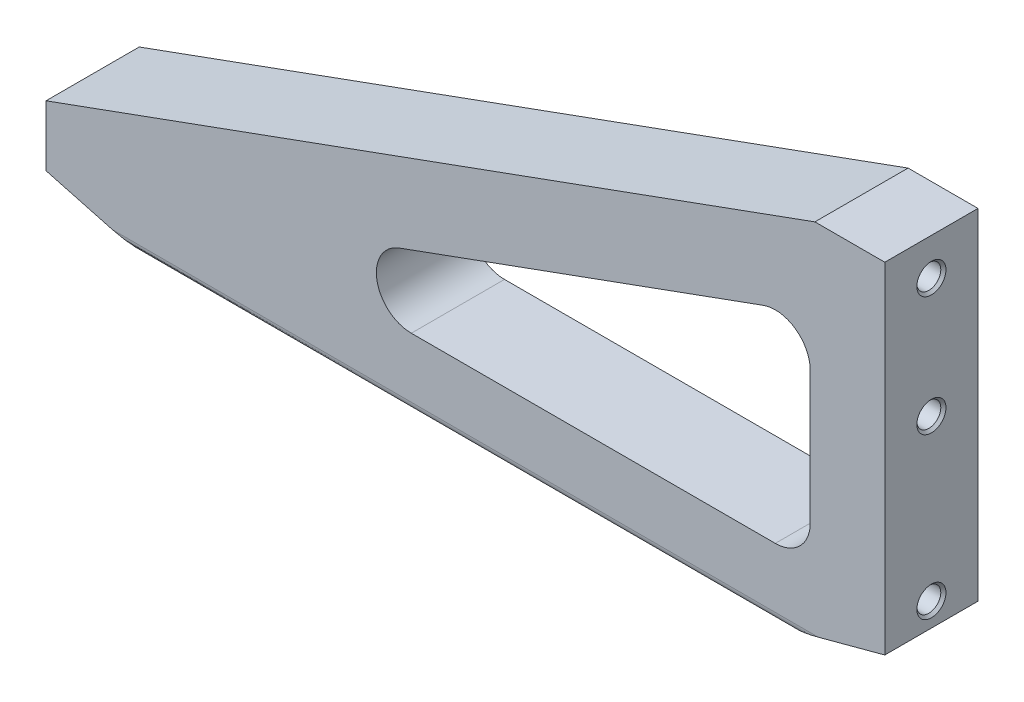
ISO-10303-21;
HEADER;
FILE_DESCRIPTION(('STEP AP214'),'2;1');
FILE_NAME('part.step','',(''),(''),'','','');
FILE_SCHEMA(('AUTOMOTIVE_DESIGN { 1 0 10303 214 1 1 1 1 }'));
ENDSEC;
DATA;
#1=APPLICATION_CONTEXT('core data for automotive mechanical design processes');
#2=APPLICATION_PROTOCOL_DEFINITION('international standard','automotive_design',2000,#1);
#3=PRODUCT_CONTEXT('',#1,'mechanical');
#4=PRODUCT('Part','Part','',(#3));
#5=PRODUCT_RELATED_PRODUCT_CATEGORY('part','',(#4));
#6=PRODUCT_DEFINITION_FORMATION('','',#4);
#7=PRODUCT_DEFINITION_CONTEXT('part definition',#1,'design');
#8=PRODUCT_DEFINITION('design','',#6,#7);
#9=PRODUCT_DEFINITION_SHAPE('','',#8);
#10=(LENGTH_UNIT() NAMED_UNIT(*) SI_UNIT(.MILLI.,.METRE.));
#11=(NAMED_UNIT(*) PLANE_ANGLE_UNIT() SI_UNIT($,.RADIAN.));
#12=(NAMED_UNIT(*) SI_UNIT($,.STERADIAN.) SOLID_ANGLE_UNIT());
#13=UNCERTAINTY_MEASURE_WITH_UNIT(LENGTH_MEASURE(1.E-05),#10,'distance_accuracy_value','');
#14=(GEOMETRIC_REPRESENTATION_CONTEXT(3) GLOBAL_UNCERTAINTY_ASSIGNED_CONTEXT((#13)) GLOBAL_UNIT_ASSIGNED_CONTEXT((#10,
#11,#12)) REPRESENTATION_CONTEXT('',''));
#15=CARTESIAN_POINT('',(0.,0.,0.));
#16=DIRECTION('',(0.,0.,1.));
#17=DIRECTION('',(1.,0.,0.));
#18=AXIS2_PLACEMENT_3D('',#15,#16,#17);
#19=CARTESIAN_POINT('',(0.,0.,12.7));
#20=DIRECTION('',(0.,0.,1.));
#21=DIRECTION('',(1.,0.,0.));
#22=AXIS2_PLACEMENT_3D('',#19,#20,#21);
#23=PLANE('',#22);
#24=DIRECTION('',(0.,1.,0.));
#25=VECTOR('',#24,1.);
#26=CARTESIAN_POINT('',(-20.32,12.5140664695066,12.7));
#27=LINE('',#26,#25);
#28=CARTESIAN_POINT('',(-20.32,-23.5585,12.7));
#29=VERTEX_POINT('',#28);
#30=CARTESIAN_POINT('',(-20.32,12.5140664695066,12.7));
#31=VERTEX_POINT('',#30);
#32=EDGE_CURVE('E206',#29,#31,#27,.T.);
#33=ORIENTED_EDGE('',*,*,#32,.F.);
#34=CARTESIAN_POINT('',(-29.845,-23.5585,12.7));
#35=DIRECTION('',(0.,0.,1.));
#36=DIRECTION('',(-1.,0.,0.));
#37=AXIS2_PLACEMENT_3D('',#34,#35,#36);
#38=CIRCLE('',#37,9.525);
#39=CARTESIAN_POINT('',(-29.845,-33.0835,12.7));
#40=VERTEX_POINT('',#39);
#41=EDGE_CURVE('E204',#40,#29,#38,.T.);
#42=ORIENTED_EDGE('',*,*,#41,.F.);
#43=DIRECTION('',(1.,0.,0.));
#44=VECTOR('',#43,1.);
#45=CARTESIAN_POINT('',(-129.044557791143,-33.0835,12.7));
#46=LINE('',#45,#44);
#47=CARTESIAN_POINT('',(-129.044557791143,-33.0835,12.7));
#48=VERTEX_POINT('',#47);
#49=EDGE_CURVE('E216',#48,#40,#46,.T.);
#50=ORIENTED_EDGE('',*,*,#49,.F.);
#51=CARTESIAN_POINT('',(-129.044557791143,-23.5585,12.7));
#52=DIRECTION('',(0.,0.,1.));
#53=DIRECTION('',(-1.,0.,0.));
#54=AXIS2_PLACEMENT_3D('',#51,#52,#53);
#55=CIRCLE('',#54,9.525);
#56=CARTESIAN_POINT('',(-132.299660467044,-14.6069676412726,12.7));
#57=VERTEX_POINT('',#56);
#58=EDGE_CURVE('E213',#57,#48,#55,.T.);
#59=ORIENTED_EDGE('',*,*,#58,.F.);
#60=DIRECTION('',(-0.939793423488437,-0.341743063086704,0.));
#61=VECTOR('',#60,1.);
#62=CARTESIAN_POINT('',(-33.1001026759009,21.465598828234,12.7));
#63=LINE('',#62,#61);
#64=CARTESIAN_POINT('',(-33.1001026759009,21.465598828234,12.7));
#65=VERTEX_POINT('',#64);
#66=EDGE_CURVE('E211',#65,#57,#63,.T.);
#67=ORIENTED_EDGE('',*,*,#66,.F.);
#68=CARTESIAN_POINT('',(-29.845,12.5140664695066,12.7));
#69=DIRECTION('',(0.,0.,1.));
#70=DIRECTION('',(-1.,0.,0.));
#71=AXIS2_PLACEMENT_3D('',#68,#69,#70);
#72=CIRCLE('',#71,9.525);
#73=EDGE_CURVE('E209',#31,#65,#72,.T.);
#74=ORIENTED_EDGE('',*,*,#73,.F.);
#75=EDGE_LOOP('',(#33,#42,#50,#59,#67,#74));
#76=FACE_BOUND('',#75,.T.);
#77=DIRECTION('',(0.965925826289068,-0.258819045102524,0.));
#78=VECTOR('',#77,1.);
#79=CARTESIAN_POINT('',(-228.6,-44.5135,12.7));
#80=LINE('',#79,#78);
#81=CARTESIAN_POINT('',(-228.6,-44.5135,12.7));
#82=VERTEX_POINT('',#81);
#83=CARTESIAN_POINT('',(-210.457748922224,-49.3747015251728,12.7));
#84=VERTEX_POINT('',#83);
#85=EDGE_CURVE('E259',#82,#84,#80,.T.);
#86=ORIENTED_EDGE('',*,*,#85,.T.);
#87=DIRECTION('',(1.,0.,0.));
#88=VECTOR('',#87,1.);
#89=CARTESIAN_POINT('',(0.,-49.3747015251727,12.7));
#90=LINE('',#89,#88);
#91=CARTESIAN_POINT('',(-18.1422510777758,-49.3747015251727,12.7));
#92=VERTEX_POINT('',#91);
#93=EDGE_CURVE('E14',#84,#92,#90,.T.);
#94=ORIENTED_EDGE('',*,*,#93,.T.);
#95=DIRECTION('',(0.965925826289068,0.258819045102522,0.));
#96=VECTOR('',#95,1.);
#97=CARTESIAN_POINT('',(-33.1779316792872,-53.4035,12.7));
#98=LINE('',#97,#96);
#99=CARTESIAN_POINT('',(0.,-44.5135,12.7));
#100=VERTEX_POINT('',#99);
#101=EDGE_CURVE('E261',#92,#100,#98,.T.);
#102=ORIENTED_EDGE('',*,*,#101,.T.);
#103=DIRECTION('',(0.,1.,0.));
#104=VECTOR('',#103,1.);
#105=CARTESIAN_POINT('',(0.,48.1965,12.7));
#106=LINE('',#105,#104);
#107=CARTESIAN_POINT('',(0.,48.1965,12.7));
#108=VERTEX_POINT('',#107);
#109=EDGE_CURVE('E249',#100,#108,#106,.T.);
#110=ORIENTED_EDGE('',*,*,#109,.T.);
#111=DIRECTION('',(-1.,0.,0.));
#112=VECTOR('',#111,1.);
#113=CARTESIAN_POINT('',(-19.05,48.1965,12.7));
#114=LINE('',#113,#112);
#115=CARTESIAN_POINT('',(-19.05,48.1965,12.7));
#116=VERTEX_POINT('',#115);
#117=EDGE_CURVE('E252',#108,#116,#114,.T.);
#118=ORIENTED_EDGE('',*,*,#117,.T.);
#119=DIRECTION('',(-0.939793423488437,-0.341743063086704,0.));
#120=VECTOR('',#119,1.);
#121=CARTESIAN_POINT('',(-19.05,48.1965,12.7));
#122=LINE('',#121,#120);
#123=CARTESIAN_POINT('',(-228.6,-28.0035,12.7));
#124=VERTEX_POINT('',#123);
#125=EDGE_CURVE('E255',#116,#124,#122,.T.);
#126=ORIENTED_EDGE('',*,*,#125,.T.);
#127=DIRECTION('',(0.,-1.,0.));
#128=VECTOR('',#127,1.);
#129=CARTESIAN_POINT('',(-228.6,-28.0035,12.7));
#130=LINE('',#129,#128);
#131=EDGE_CURVE('E257',#124,#82,#130,.T.);
#132=ORIENTED_EDGE('',*,*,#131,.T.);
#133=EDGE_LOOP('',(#86,#94,#102,#110,#118,#126,#132));
#134=FACE_BOUND('',#133,.T.);
#135=ADVANCED_FACE('F52',(#76,#134),#23,.T.);
#136=CARTESIAN_POINT('',(0.,0.,-12.7));
#137=DIRECTION('',(0.,0.,1.));
#138=DIRECTION('',(1.,0.,0.));
#139=AXIS2_PLACEMENT_3D('',#136,#137,#138);
#140=PLANE('',#139);
#141=CARTESIAN_POINT('',(-29.845,-23.5585,-12.7));
#142=DIRECTION('',(0.,0.,1.));
#143=DIRECTION('',(-1.,0.,0.));
#144=AXIS2_PLACEMENT_3D('',#141,#142,#143);
#145=CIRCLE('',#144,9.525);
#146=CARTESIAN_POINT('',(-29.845,-33.0835,-12.7));
#147=VERTEX_POINT('',#146);
#148=CARTESIAN_POINT('',(-20.32,-23.5585,-12.7));
#149=VERTEX_POINT('',#148);
#150=EDGE_CURVE('E203',#147,#149,#145,.T.);
#151=ORIENTED_EDGE('',*,*,#150,.T.);
#152=DIRECTION('',(0.,1.,0.));
#153=VECTOR('',#152,1.);
#154=CARTESIAN_POINT('',(-20.32,12.5140664695066,-12.7));
#155=LINE('',#154,#153);
#156=CARTESIAN_POINT('',(-20.32,12.5140664695066,-12.7));
#157=VERTEX_POINT('',#156);
#158=EDGE_CURVE('E221',#149,#157,#155,.T.);
#159=ORIENTED_EDGE('',*,*,#158,.T.);
#160=CARTESIAN_POINT('',(-29.845,12.5140664695066,-12.7));
#161=DIRECTION('',(0.,0.,1.));
#162=DIRECTION('',(-1.,0.,0.));
#163=AXIS2_PLACEMENT_3D('',#160,#161,#162);
#164=CIRCLE('',#163,9.525);
#165=CARTESIAN_POINT('',(-33.1001026759009,21.465598828234,-12.7));
#166=VERTEX_POINT('',#165);
#167=EDGE_CURVE('E224',#157,#166,#164,.T.);
#168=ORIENTED_EDGE('',*,*,#167,.T.);
#169=DIRECTION('',(-0.939793423488437,-0.341743063086704,0.));
#170=VECTOR('',#169,1.);
#171=CARTESIAN_POINT('',(-33.1001026759009,21.465598828234,-12.7));
#172=LINE('',#171,#170);
#173=CARTESIAN_POINT('',(-132.299660467044,-14.6069676412726,-12.7));
#174=VERTEX_POINT('',#173);
#175=EDGE_CURVE('E227',#166,#174,#172,.T.);
#176=ORIENTED_EDGE('',*,*,#175,.T.);
#177=CARTESIAN_POINT('',(-129.044557791143,-23.5585,-12.7));
#178=DIRECTION('',(0.,0.,1.));
#179=DIRECTION('',(-1.,0.,0.));
#180=AXIS2_PLACEMENT_3D('',#177,#178,#179);
#181=CIRCLE('',#180,9.525);
#182=CARTESIAN_POINT('',(-129.044557791143,-33.0835,-12.7));
#183=VERTEX_POINT('',#182);
#184=EDGE_CURVE('E230',#174,#183,#181,.T.);
#185=ORIENTED_EDGE('',*,*,#184,.T.);
#186=DIRECTION('',(1.,0.,0.));
#187=VECTOR('',#186,1.);
#188=CARTESIAN_POINT('',(-129.044557791143,-33.0835,-12.7));
#189=LINE('',#188,#187);
#190=EDGE_CURVE('E207',#183,#147,#189,.T.);
#191=ORIENTED_EDGE('',*,*,#190,.T.);
#192=EDGE_LOOP('',(#151,#159,#168,#176,#185,#191));
#193=FACE_BOUND('',#192,.T.);
#194=DIRECTION('',(0.965925826289068,0.258819045102522,0.));
#195=VECTOR('',#194,1.);
#196=CARTESIAN_POINT('',(-33.1779316792872,-53.4035,-12.7));
#197=LINE('',#196,#195);
#198=CARTESIAN_POINT('',(-18.1422510777758,-49.3747015251727,-12.7));
#199=VERTEX_POINT('',#198);
#200=CARTESIAN_POINT('',(0.,-44.5135,-12.7));
#201=VERTEX_POINT('',#200);
#202=EDGE_CURVE('E253',#199,#201,#197,.T.);
#203=ORIENTED_EDGE('',*,*,#202,.F.);
#204=DIRECTION('',(-1.,0.,0.));
#205=VECTOR('',#204,1.);
#206=CARTESIAN_POINT('',(-201.685266575725,-49.3747015251728,-12.7));
#207=LINE('',#206,#205);
#208=CARTESIAN_POINT('',(-210.457748922224,-49.3747015251728,-12.7));
#209=VERTEX_POINT('',#208);
#210=EDGE_CURVE('E75',#199,#209,#207,.T.);
#211=ORIENTED_EDGE('',*,*,#210,.T.);
#212=DIRECTION('',(0.965925826289068,-0.258819045102524,0.));
#213=VECTOR('',#212,1.);
#214=CARTESIAN_POINT('',(-228.6,-44.5135,-12.7));
#215=LINE('',#214,#213);
#216=CARTESIAN_POINT('',(-228.6,-44.5135,-12.7));
#217=VERTEX_POINT('',#216);
#218=EDGE_CURVE('E272',#217,#209,#215,.T.);
#219=ORIENTED_EDGE('',*,*,#218,.F.);
#220=DIRECTION('',(0.,-1.,0.));
#221=VECTOR('',#220,1.);
#222=CARTESIAN_POINT('',(-228.6,-28.0035,-12.7));
#223=LINE('',#222,#221);
#224=CARTESIAN_POINT('',(-228.6,-28.0035,-12.7));
#225=VERTEX_POINT('',#224);
#226=EDGE_CURVE('E270',#225,#217,#223,.T.);
#227=ORIENTED_EDGE('',*,*,#226,.F.);
#228=DIRECTION('',(-0.939793423488437,-0.341743063086704,0.));
#229=VECTOR('',#228,1.);
#230=CARTESIAN_POINT('',(-19.05,48.1965,-12.7));
#231=LINE('',#230,#229);
#232=CARTESIAN_POINT('',(-19.05,48.1965,-12.7));
#233=VERTEX_POINT('',#232);
#234=EDGE_CURVE('E268',#233,#225,#231,.T.);
#235=ORIENTED_EDGE('',*,*,#234,.F.);
#236=DIRECTION('',(-1.,0.,0.));
#237=VECTOR('',#236,1.);
#238=CARTESIAN_POINT('',(-19.05,48.1965,-12.7));
#239=LINE('',#238,#237);
#240=CARTESIAN_POINT('',(0.,48.1965,-12.7));
#241=VERTEX_POINT('',#240);
#242=EDGE_CURVE('E266',#241,#233,#239,.T.);
#243=ORIENTED_EDGE('',*,*,#242,.F.);
#244=DIRECTION('',(0.,1.,0.));
#245=VECTOR('',#244,1.);
#246=CARTESIAN_POINT('',(0.,48.1965,-12.7));
#247=LINE('',#246,#245);
#248=EDGE_CURVE('E248',#201,#241,#247,.T.);
#249=ORIENTED_EDGE('',*,*,#248,.F.);
#250=EDGE_LOOP('',(#203,#211,#219,#227,#235,#243,#249));
#251=FACE_BOUND('',#250,.T.);
#252=ADVANCED_FACE('F320',(#193,#251),#140,.F.);
#253=CARTESIAN_POINT('',(-228.6,-44.5135,12.7));
#254=DIRECTION('',(0.258819045102524,0.965925826289068,0.));
#255=DIRECTION('',(-0.965925826289068,0.258819045102524,0.));
#256=AXIS2_PLACEMENT_3D('',#253,#254,#255);
#257=PLANE('',#256);
#258=ORIENTED_EDGE('',*,*,#218,.T.);
#259=CARTESIAN_POINT('',(-210.457748922224,-49.3747015251728,-10.31875));
#260=DIRECTION('',(0.258819045102524,0.965925826289068,0.));
#261=DIRECTION('',(0.965925826289068,-0.258819045102524,0.));
#262=AXIS2_PLACEMENT_3D('',#259,#260,#261);
#263=ELLIPSE('',#262,9.20044349540327,2.38125);
#264=CARTESIAN_POINT('',(-201.571404827368,-51.7557902490546,-10.3464637421665));
#265=VERTEX_POINT('',#264);
#266=EDGE_CURVE('E60',#209,#265,#263,.F.);
#267=ORIENTED_EDGE('',*,*,#266,.T.);
#268=CARTESIAN_POINT('',(-3519.13986690642,837.183999999999,0.));
#269=DIRECTION('',(0.258819045102524,0.965925826289068,0.));
#270=DIRECTION('',(0.965925826289068,-0.258819045102524,0.));
#271=AXIS2_PLACEMENT_3D('',#268,#269,#270);
#272=ELLIPSE('',#271,3434.83223828389,889.);
#273=CARTESIAN_POINT('',(-201.571404827368,-51.7557902490546,10.3464637421669));
#274=VERTEX_POINT('',#273);
#275=EDGE_CURVE('E307',#274,#265,#272,.T.);
#276=ORIENTED_EDGE('',*,*,#275,.F.);
#277=CARTESIAN_POINT('',(-210.457748922224,-49.3747015251728,10.31875));
#278=DIRECTION('',(0.258819045102524,0.965925826289068,0.));
#279=DIRECTION('',(0.965925826289068,-0.258819045102524,0.));
#280=AXIS2_PLACEMENT_3D('',#277,#278,#279);
#281=ELLIPSE('',#280,9.20044349540327,2.38125);
#282=EDGE_CURVE('E67',#274,#84,#281,.F.);
#283=ORIENTED_EDGE('',*,*,#282,.T.);
#284=ORIENTED_EDGE('',*,*,#85,.F.);
#285=DIRECTION('',(0.,0.,-1.));
#286=VECTOR('',#285,1.);
#287=CARTESIAN_POINT('',(-228.6,-44.5135,12.7));
#288=LINE('',#287,#286);
#289=EDGE_CURVE('E277',#82,#217,#288,.T.);
#290=ORIENTED_EDGE('',*,*,#289,.T.);
#291=EDGE_LOOP('',(#258,#267,#276,#283,#284,#290));
#292=FACE_BOUND('',#291,.T.);
#293=ADVANCED_FACE('F306',(#292),#257,.F.);
#294=CARTESIAN_POINT('',(-33.1779316792872,-53.4035,12.7));
#295=DIRECTION('',(-0.258819045102522,0.965925826289068,0.));
#296=DIRECTION('',(-0.965925826289068,-0.258819045102522,0.));
#297=AXIS2_PLACEMENT_3D('',#294,#295,#296);
#298=PLANE('',#297);
#299=CARTESIAN_POINT('',(3290.53986690645,837.184000000001,0.));
#300=DIRECTION('',(-0.258819045102522,0.965925826289068,0.));
#301=DIRECTION('',(0.965925826289068,0.258819045102522,0.));
#302=AXIS2_PLACEMENT_3D('',#299,#300,#301);
#303=ELLIPSE('',#302,3434.83223828392,889.);
#304=CARTESIAN_POINT('',(-27.0285951726317,-51.7557902490545,-10.3464637421663));
#305=VERTEX_POINT('',#304);
#306=CARTESIAN_POINT('',(-27.0285951726317,-51.7557902490545,10.3464637421661));
#307=VERTEX_POINT('',#306);
#308=EDGE_CURVE('E289',#305,#307,#303,.T.);
#309=ORIENTED_EDGE('',*,*,#308,.F.);
#310=CARTESIAN_POINT('',(-18.1422510777758,-49.3747015251727,-10.31875));
#311=DIRECTION('',(-0.258819045102522,0.965925826289068,0.));
#312=DIRECTION('',(0.965925826289068,0.258819045102522,0.));
#313=AXIS2_PLACEMENT_3D('',#310,#311,#312);
#314=ELLIPSE('',#313,9.20044349540336,2.38125);
#315=EDGE_CURVE('E301',#305,#199,#314,.F.);
#316=ORIENTED_EDGE('',*,*,#315,.T.);
#317=ORIENTED_EDGE('',*,*,#202,.T.);
#318=DIRECTION('',(0.,0.,-1.));
#319=VECTOR('',#318,1.);
#320=CARTESIAN_POINT('',(0.,-44.5135,12.7));
#321=LINE('',#320,#319);
#322=EDGE_CURVE('E263',#100,#201,#321,.T.);
#323=ORIENTED_EDGE('',*,*,#322,.F.);
#324=ORIENTED_EDGE('',*,*,#101,.F.);
#325=CARTESIAN_POINT('',(-18.1422510777758,-49.3747015251727,10.31875));
#326=DIRECTION('',(-0.258819045102522,0.965925826289068,0.));
#327=DIRECTION('',(0.965925826289068,0.258819045102522,0.));
#328=AXIS2_PLACEMENT_3D('',#325,#326,#327);
#329=ELLIPSE('',#328,9.20044349540336,2.38125);
#330=EDGE_CURVE('E299',#92,#307,#329,.F.);
#331=ORIENTED_EDGE('',*,*,#330,.T.);
#332=EDGE_LOOP('',(#309,#316,#317,#323,#324,#331));
#333=FACE_BOUND('',#332,.T.);
#334=ADVANCED_FACE('F317',(#333),#298,.F.);
#335=CARTESIAN_POINT('',(0.,48.1965,12.7));
#336=DIRECTION('',(-1.,0.,0.));
#337=DIRECTION('',(0.,-1.,0.));
#338=AXIS2_PLACEMENT_3D('',#335,#336,#337);
#339=PLANE('',#338);
#340=CARTESIAN_POINT('',(0.,-38.1,0.));
#341=DIRECTION('',(1.,0.,0.));
#342=DIRECTION('',(0.,0.,-1.));
#343=AXIS2_PLACEMENT_3D('',#340,#341,#342);
#344=CIRCLE('',#343,3.96875);
#345=CARTESIAN_POINT('',(0.,-38.1,-3.96875000000001));
#346=VERTEX_POINT('',#345);
#347=EDGE_CURVE('E184',#346,#346,#344,.T.);
#348=ORIENTED_EDGE('',*,*,#347,.F.);
#349=EDGE_LOOP('',(#348));
#350=FACE_BOUND('',#349,.T.);
#351=CARTESIAN_POINT('',(0.,5.53719999999999,0.));
#352=DIRECTION('',(1.,0.,0.));
#353=DIRECTION('',(0.,0.,-1.));
#354=AXIS2_PLACEMENT_3D('',#351,#352,#353);
#355=CIRCLE('',#354,3.96875);
#356=CARTESIAN_POINT('',(0.,5.53719999999999,-3.96875000000001));
#357=VERTEX_POINT('',#356);
#358=EDGE_CURVE('E177',#357,#357,#355,.T.);
#359=ORIENTED_EDGE('',*,*,#358,.F.);
#360=EDGE_LOOP('',(#359));
#361=FACE_BOUND('',#360,.T.);
#362=CARTESIAN_POINT('',(0.,38.1,0.));
#363=DIRECTION('',(1.,0.,0.));
#364=DIRECTION('',(0.,0.,-1.));
#365=AXIS2_PLACEMENT_3D('',#362,#363,#364);
#366=CIRCLE('',#365,3.96875);
#367=CARTESIAN_POINT('',(0.,38.1,-3.96875000000001));
#368=VERTEX_POINT('',#367);
#369=EDGE_CURVE('E194',#368,#368,#366,.T.);
#370=ORIENTED_EDGE('',*,*,#369,.F.);
#371=EDGE_LOOP('',(#370));
#372=FACE_BOUND('',#371,.T.);
#373=ORIENTED_EDGE('',*,*,#248,.T.);
#374=DIRECTION('',(0.,0.,-1.));
#375=VECTOR('',#374,1.);
#376=CARTESIAN_POINT('',(0.,48.1965,12.7));
#377=LINE('',#376,#375);
#378=EDGE_CURVE('E286',#108,#241,#377,.T.);
#379=ORIENTED_EDGE('',*,*,#378,.F.);
#380=ORIENTED_EDGE('',*,*,#109,.F.);
#381=ORIENTED_EDGE('',*,*,#322,.T.);
#382=EDGE_LOOP('',(#373,#379,#380,#381));
#383=FACE_BOUND('',#382,.T.);
#384=ADVANCED_FACE('F324',(#350,#361,#372,#383),#339,.F.);
#385=CARTESIAN_POINT('',(-19.05,48.1965,12.7));
#386=DIRECTION('',(0.,-1.,0.));
#387=DIRECTION('',(0.,0.,-1.));
#388=AXIS2_PLACEMENT_3D('',#385,#386,#387);
#389=PLANE('',#388);
#390=ORIENTED_EDGE('',*,*,#242,.T.);
#391=DIRECTION('',(0.,0.,-1.));
#392=VECTOR('',#391,1.);
#393=CARTESIAN_POINT('',(-19.05,48.1965,12.7));
#394=LINE('',#393,#392);
#395=EDGE_CURVE('E283',#116,#233,#394,.T.);
#396=ORIENTED_EDGE('',*,*,#395,.F.);
#397=ORIENTED_EDGE('',*,*,#117,.F.);
#398=ORIENTED_EDGE('',*,*,#378,.T.);
#399=EDGE_LOOP('',(#390,#396,#397,#398));
#400=FACE_BOUND('',#399,.T.);
#401=ADVANCED_FACE('F358',(#400),#389,.F.);
#402=CARTESIAN_POINT('',(-19.05,48.1965,12.7));
#403=DIRECTION('',(0.341743063086704,-0.939793423488437,0.));
#404=DIRECTION('',(0.939793423488437,0.341743063086704,0.));
#405=AXIS2_PLACEMENT_3D('',#402,#403,#404);
#406=PLANE('',#405);
#407=ORIENTED_EDGE('',*,*,#234,.T.);
#408=DIRECTION('',(0.,0.,-1.));
#409=VECTOR('',#408,1.);
#410=CARTESIAN_POINT('',(-228.6,-28.0035,12.7));
#411=LINE('',#410,#409);
#412=EDGE_CURVE('E280',#124,#225,#411,.T.);
#413=ORIENTED_EDGE('',*,*,#412,.F.);
#414=ORIENTED_EDGE('',*,*,#125,.F.);
#415=ORIENTED_EDGE('',*,*,#395,.T.);
#416=EDGE_LOOP('',(#407,#413,#414,#415));
#417=FACE_BOUND('',#416,.T.);
#418=ADVANCED_FACE('F354',(#417),#406,.F.);
#419=CARTESIAN_POINT('',(-228.6,-28.0035,12.7));
#420=DIRECTION('',(1.,0.,0.));
#421=DIRECTION('',(0.,0.,-1.));
#422=AXIS2_PLACEMENT_3D('',#419,#420,#421);
#423=PLANE('',#422);
#424=ORIENTED_EDGE('',*,*,#226,.T.);
#425=ORIENTED_EDGE('',*,*,#289,.F.);
#426=ORIENTED_EDGE('',*,*,#131,.F.);
#427=ORIENTED_EDGE('',*,*,#412,.T.);
#428=EDGE_LOOP('',(#424,#425,#426,#427));
#429=FACE_BOUND('',#428,.T.);
#430=ADVANCED_FACE('F351',(#429),#423,.F.);
#431=CARTESIAN_POINT('',(-29.845,-23.5585,12.7));
#432=DIRECTION('',(0.,0.,-1.));
#433=DIRECTION('',(-1.,0.,0.));
#434=AXIS2_PLACEMENT_3D('',#431,#432,#433);
#435=CYLINDRICAL_SURFACE('',#434,9.525);
#436=ORIENTED_EDGE('',*,*,#150,.F.);
#437=DIRECTION('',(0.,0.,-1.));
#438=VECTOR('',#437,1.);
#439=CARTESIAN_POINT('',(-29.845,-33.0835,12.7));
#440=LINE('',#439,#438);
#441=EDGE_CURVE('E218',#40,#147,#440,.T.);
#442=ORIENTED_EDGE('',*,*,#441,.F.);
#443=ORIENTED_EDGE('',*,*,#41,.T.);
#444=DIRECTION('',(0.,0.,-1.));
#445=VECTOR('',#444,1.);
#446=CARTESIAN_POINT('',(-20.32,-23.5585,12.7));
#447=LINE('',#446,#445);
#448=EDGE_CURVE('E245',#29,#149,#447,.T.);
#449=ORIENTED_EDGE('',*,*,#448,.T.);
#450=EDGE_LOOP('',(#436,#442,#443,#449));
#451=FACE_BOUND('',#450,.T.);
#452=ADVANCED_FACE('F344',(#451),#435,.F.);
#453=CARTESIAN_POINT('',(-20.32,12.5140664695066,12.7));
#454=DIRECTION('',(-1.,0.,0.));
#455=DIRECTION('',(0.,-1.,0.));
#456=AXIS2_PLACEMENT_3D('',#453,#454,#455);
#457=PLANE('',#456);
#458=CARTESIAN_POINT('',(-20.32,5.53719999999999,0.));
#459=DIRECTION('',(-1.,0.,0.));
#460=DIRECTION('',(0.,-1.,0.));
#461=AXIS2_PLACEMENT_3D('',#458,#459,#460);
#462=CIRCLE('',#461,2.92571840918638);
#463=CARTESIAN_POINT('',(-20.32,2.61148159081361,0.));
#464=VERTEX_POINT('',#463);
#465=EDGE_CURVE('E193',#464,#464,#462,.T.);
#466=ORIENTED_EDGE('',*,*,#465,.F.);
#467=EDGE_LOOP('',(#466));
#468=FACE_BOUND('',#467,.T.);
#469=ORIENTED_EDGE('',*,*,#158,.F.);
#470=ORIENTED_EDGE('',*,*,#448,.F.);
#471=ORIENTED_EDGE('',*,*,#32,.T.);
#472=DIRECTION('',(0.,0.,-1.));
#473=VECTOR('',#472,1.);
#474=CARTESIAN_POINT('',(-20.32,12.5140664695066,12.7));
#475=LINE('',#474,#473);
#476=EDGE_CURVE('E243',#31,#157,#475,.T.);
#477=ORIENTED_EDGE('',*,*,#476,.T.);
#478=EDGE_LOOP('',(#469,#470,#471,#477));
#479=FACE_BOUND('',#478,.T.);
#480=ADVANCED_FACE('F410',(#468,#479),#457,.T.);
#481=CARTESIAN_POINT('',(-29.845,12.5140664695066,12.7));
#482=DIRECTION('',(0.,0.,-1.));
#483=DIRECTION('',(-1.,0.,0.));
#484=AXIS2_PLACEMENT_3D('',#481,#482,#483);
#485=CYLINDRICAL_SURFACE('',#484,9.525);
#486=ORIENTED_EDGE('',*,*,#167,.F.);
#487=ORIENTED_EDGE('',*,*,#476,.F.);
#488=ORIENTED_EDGE('',*,*,#73,.T.);
#489=DIRECTION('',(0.,0.,-1.));
#490=VECTOR('',#489,1.);
#491=CARTESIAN_POINT('',(-33.1001026759009,21.465598828234,12.7));
#492=LINE('',#491,#490);
#493=EDGE_CURVE('E241',#65,#166,#492,.T.);
#494=ORIENTED_EDGE('',*,*,#493,.T.);
#495=EDGE_LOOP('',(#486,#487,#488,#494));
#496=FACE_BOUND('',#495,.T.);
#497=ADVANCED_FACE('F407',(#496),#485,.F.);
#498=CARTESIAN_POINT('',(-33.1001026759009,21.465598828234,12.7));
#499=DIRECTION('',(0.341743063086704,-0.939793423488437,0.));
#500=DIRECTION('',(0.939793423488437,0.341743063086704,0.));
#501=AXIS2_PLACEMENT_3D('',#498,#499,#500);
#502=PLANE('',#501);
#503=ORIENTED_EDGE('',*,*,#175,.F.);
#504=ORIENTED_EDGE('',*,*,#493,.F.);
#505=ORIENTED_EDGE('',*,*,#66,.T.);
#506=DIRECTION('',(0.,0.,-1.));
#507=VECTOR('',#506,1.);
#508=CARTESIAN_POINT('',(-132.299660467044,-14.6069676412726,12.7));
#509=LINE('',#508,#507);
#510=EDGE_CURVE('E239',#57,#174,#509,.T.);
#511=ORIENTED_EDGE('',*,*,#510,.T.);
#512=EDGE_LOOP('',(#503,#504,#505,#511));
#513=FACE_BOUND('',#512,.T.);
#514=ADVANCED_FACE('F403',(#513),#502,.T.);
#515=CARTESIAN_POINT('',(-129.044557791143,-23.5585,12.7));
#516=DIRECTION('',(0.,0.,-1.));
#517=DIRECTION('',(-1.,0.,0.));
#518=AXIS2_PLACEMENT_3D('',#515,#516,#517);
#519=CYLINDRICAL_SURFACE('',#518,9.525);
#520=ORIENTED_EDGE('',*,*,#184,.F.);
#521=ORIENTED_EDGE('',*,*,#510,.F.);
#522=ORIENTED_EDGE('',*,*,#58,.T.);
#523=DIRECTION('',(0.,0.,-1.));
#524=VECTOR('',#523,1.);
#525=CARTESIAN_POINT('',(-129.044557791143,-33.0835,12.7));
#526=LINE('',#525,#524);
#527=EDGE_CURVE('E237',#48,#183,#526,.T.);
#528=ORIENTED_EDGE('',*,*,#527,.T.);
#529=EDGE_LOOP('',(#520,#521,#522,#528));
#530=FACE_BOUND('',#529,.T.);
#531=ADVANCED_FACE('F399',(#530),#519,.F.);
#532=CARTESIAN_POINT('',(-129.044557791143,-33.0835,12.7));
#533=DIRECTION('',(0.,1.,0.));
#534=DIRECTION('',(0.,0.,1.));
#535=AXIS2_PLACEMENT_3D('',#532,#533,#534);
#536=PLANE('',#535);
#537=ORIENTED_EDGE('',*,*,#190,.F.);
#538=ORIENTED_EDGE('',*,*,#527,.F.);
#539=ORIENTED_EDGE('',*,*,#49,.T.);
#540=ORIENTED_EDGE('',*,*,#441,.T.);
#541=EDGE_LOOP('',(#537,#538,#539,#540));
#542=FACE_BOUND('',#541,.T.);
#543=ADVANCED_FACE('F395',(#542),#536,.T.);
#544=CARTESIAN_POINT('',(-20.1168,38.1,0.));
#545=DIRECTION('',(1.,0.,0.));
#546=DIRECTION('',(0.,0.,-1.));
#547=AXIS2_PLACEMENT_3D('',#544,#545,#546);
#548=CONICAL_SURFACE('',#547,3.26389999999999,1.02974425867665);
#549=CARTESIAN_POINT('',(-22.0779489744441,38.1,0.));
#550=VERTEX_POINT('',#549);
#551=VERTEX_LOOP('',#550);
#552=FACE_BOUND('',#551,.T.);
#553=CARTESIAN_POINT('',(-20.1168,38.1,0.));
#554=DIRECTION('',(1.,0.,0.));
#555=DIRECTION('',(0.,0.,-1.));
#556=AXIS2_PLACEMENT_3D('',#553,#554,#555);
#557=CIRCLE('',#556,3.26389999999999);
#558=CARTESIAN_POINT('',(-20.1168,38.1,-3.26390000000001));
#559=VERTEX_POINT('',#558);
#560=EDGE_CURVE('E200',#559,#559,#557,.T.);
#561=ORIENTED_EDGE('',*,*,#560,.T.);
#562=EDGE_LOOP('',(#561));
#563=FACE_BOUND('',#562,.T.);
#564=ADVANCED_FACE('F387',(#552,#563),#548,.F.);
#565=CARTESIAN_POINT('',(0.,38.1,0.));
#566=DIRECTION('',(1.,0.,0.));
#567=DIRECTION('',(0.,0.,-1.));
#568=AXIS2_PLACEMENT_3D('',#565,#566,#567);
#569=CYLINDRICAL_SURFACE('',#568,3.2639);
#570=ORIENTED_EDGE('',*,*,#560,.F.);
#571=EDGE_LOOP('',(#570));
#572=FACE_BOUND('',#571,.T.);
#573=CARTESIAN_POINT('',(-0.704850000000005,38.1,0.));
#574=DIRECTION('',(1.,0.,0.));
#575=DIRECTION('',(0.,0.,-1.));
#576=AXIS2_PLACEMENT_3D('',#573,#574,#575);
#577=CIRCLE('',#576,3.2639);
#578=CARTESIAN_POINT('',(-0.704850000000005,38.1,-3.26390000000001));
#579=VERTEX_POINT('',#578);
#580=EDGE_CURVE('E197',#579,#579,#577,.T.);
#581=ORIENTED_EDGE('',*,*,#580,.T.);
#582=EDGE_LOOP('',(#581));
#583=FACE_BOUND('',#582,.T.);
#584=ADVANCED_FACE('F377',(#572,#583),#569,.F.);
#585=CARTESIAN_POINT('',(0.,38.1,0.));
#586=DIRECTION('',(1.,0.,0.));
#587=DIRECTION('',(0.,0.,-1.));
#588=AXIS2_PLACEMENT_3D('',#585,#586,#587);
#589=CONICAL_SURFACE('',#588,3.96875,0.785398163397448);
#590=ORIENTED_EDGE('',*,*,#580,.F.);
#591=EDGE_LOOP('',(#590));
#592=FACE_BOUND('',#591,.T.);
#593=ORIENTED_EDGE('',*,*,#369,.T.);
#594=EDGE_LOOP('',(#593));
#595=FACE_BOUND('',#594,.T.);
#596=ADVANCED_FACE('F374',(#592,#595),#589,.F.);
#597=CARTESIAN_POINT('',(-20.1168,5.53719999999999,0.));
#598=DIRECTION('',(1.,0.,0.));
#599=DIRECTION('',(0.,0.,-1.));
#600=AXIS2_PLACEMENT_3D('',#597,#598,#599);
#601=CONICAL_SURFACE('',#600,3.2639,1.02974425867665);
#602=ORIENTED_EDGE('',*,*,#465,.T.);
#603=EDGE_LOOP('',(#602));
#604=FACE_BOUND('',#603,.T.);
#605=CARTESIAN_POINT('',(-20.1168,5.53719999999999,0.));
#606=DIRECTION('',(1.,0.,0.));
#607=DIRECTION('',(0.,0.,-1.));
#608=AXIS2_PLACEMENT_3D('',#605,#606,#607);
#609=CIRCLE('',#608,3.2639);
#610=CARTESIAN_POINT('',(-20.1168,5.53719999999999,-3.2639));
#611=VERTEX_POINT('',#610);
#612=EDGE_CURVE('E190',#611,#611,#609,.T.);
#613=ORIENTED_EDGE('',*,*,#612,.T.);
#614=EDGE_LOOP('',(#613));
#615=FACE_BOUND('',#614,.T.);
#616=ADVANCED_FACE('F376',(#604,#615),#601,.F.);
#617=CARTESIAN_POINT('',(0.,5.53719999999999,0.));
#618=DIRECTION('',(1.,0.,0.));
#619=DIRECTION('',(0.,0.,-1.));
#620=AXIS2_PLACEMENT_3D('',#617,#618,#619);
#621=CYLINDRICAL_SURFACE('',#620,3.2639);
#622=ORIENTED_EDGE('',*,*,#612,.F.);
#623=EDGE_LOOP('',(#622));
#624=FACE_BOUND('',#623,.T.);
#625=CARTESIAN_POINT('',(-0.704850000000001,5.53719999999999,0.));
#626=DIRECTION('',(1.,0.,0.));
#627=DIRECTION('',(0.,0.,-1.));
#628=AXIS2_PLACEMENT_3D('',#625,#626,#627);
#629=CIRCLE('',#628,3.2639);
#630=CARTESIAN_POINT('',(-0.704850000000001,5.53719999999999,-3.26390000000001));
#631=VERTEX_POINT('',#630);
#632=EDGE_CURVE('E181',#631,#631,#629,.T.);
#633=ORIENTED_EDGE('',*,*,#632,.T.);
#634=EDGE_LOOP('',(#633));
#635=FACE_BOUND('',#634,.T.);
#636=ADVANCED_FACE('F384',(#624,#635),#621,.F.);
#637=CARTESIAN_POINT('',(0.,5.53719999999999,0.));
#638=DIRECTION('',(1.,0.,0.));
#639=DIRECTION('',(0.,0.,-1.));
#640=AXIS2_PLACEMENT_3D('',#637,#638,#639);
#641=CONICAL_SURFACE('',#640,3.96875,0.785398163397451);
#642=ORIENTED_EDGE('',*,*,#632,.F.);
#643=EDGE_LOOP('',(#642));
#644=FACE_BOUND('',#643,.T.);
#645=ORIENTED_EDGE('',*,*,#358,.T.);
#646=EDGE_LOOP('',(#645));
#647=FACE_BOUND('',#646,.T.);
#648=ADVANCED_FACE('F171',(#644,#647),#641,.F.);
#649=CARTESIAN_POINT('',(-20.1168,-38.1,0.));
#650=DIRECTION('',(1.,0.,0.));
#651=DIRECTION('',(0.,0.,-1.));
#652=AXIS2_PLACEMENT_3D('',#649,#650,#651);
#653=CONICAL_SURFACE('',#652,3.26389999999999,1.02974425867665);
#654=CARTESIAN_POINT('',(-22.077948974444,-38.1,0.));
#655=VERTEX_POINT('',#654);
#656=VERTEX_LOOP('',#655);
#657=FACE_BOUND('',#656,.T.);
#658=CARTESIAN_POINT('',(-20.1168,-38.1,0.));
#659=DIRECTION('',(1.,0.,0.));
#660=DIRECTION('',(0.,0.,-1.));
#661=AXIS2_PLACEMENT_3D('',#658,#659,#660);
#662=CIRCLE('',#661,3.26389999999999);
#663=CARTESIAN_POINT('',(-20.1168,-38.1,-3.2639));
#664=VERTEX_POINT('',#663);
#665=EDGE_CURVE('E175',#664,#664,#662,.T.);
#666=ORIENTED_EDGE('',*,*,#665,.T.);
#667=EDGE_LOOP('',(#666));
#668=FACE_BOUND('',#667,.T.);
#669=ADVANCED_FACE('F167',(#657,#668),#653,.F.);
#670=CARTESIAN_POINT('',(0.,-38.1,0.));
#671=DIRECTION('',(1.,0.,0.));
#672=DIRECTION('',(0.,0.,-1.));
#673=AXIS2_PLACEMENT_3D('',#670,#671,#672);
#674=CYLINDRICAL_SURFACE('',#673,3.2639);
#675=ORIENTED_EDGE('',*,*,#665,.F.);
#676=EDGE_LOOP('',(#675));
#677=FACE_BOUND('',#676,.T.);
#678=CARTESIAN_POINT('',(-0.704849999999995,-38.1,0.));
#679=DIRECTION('',(1.,0.,0.));
#680=DIRECTION('',(0.,0.,-1.));
#681=AXIS2_PLACEMENT_3D('',#678,#679,#680);
#682=CIRCLE('',#681,3.2639);
#683=CARTESIAN_POINT('',(-0.704849999999995,-38.1,-3.26390000000001));
#684=VERTEX_POINT('',#683);
#685=EDGE_CURVE('E178',#684,#684,#682,.T.);
#686=ORIENTED_EDGE('',*,*,#685,.T.);
#687=EDGE_LOOP('',(#686));
#688=FACE_BOUND('',#687,.T.);
#689=ADVANCED_FACE('F170',(#677,#688),#674,.F.);
#690=CARTESIAN_POINT('',(0.,-38.1,0.));
#691=DIRECTION('',(1.,0.,0.));
#692=DIRECTION('',(0.,0.,-1.));
#693=AXIS2_PLACEMENT_3D('',#690,#691,#692);
#694=CONICAL_SURFACE('',#693,3.96875,0.785398163397448);
#695=ORIENTED_EDGE('',*,*,#685,.F.);
#696=EDGE_LOOP('',(#695));
#697=FACE_BOUND('',#696,.T.);
#698=ORIENTED_EDGE('',*,*,#347,.T.);
#699=EDGE_LOOP('',(#698));
#700=FACE_BOUND('',#699,.T.);
#701=ADVANCED_FACE('F449',(#697,#700),#694,.F.);
#702=CARTESIAN_POINT('',(-228.6,837.184,0.));
#703=DIRECTION('',(1.,0.,0.));
#704=DIRECTION('',(0.,1.,0.));
#705=AXIS2_PLACEMENT_3D('',#702,#703,#704);
#706=CYLINDRICAL_SURFACE('',#705,889.);
#707=ORIENTED_EDGE('',*,*,#275,.T.);
#708=DIRECTION('',(1.,0.,0.));
#709=VECTOR('',#708,1.);
#710=CARTESIAN_POINT('',(-228.6,-51.7557902490542,-10.3464637421665));
#711=LINE('',#710,#709);
#712=EDGE_CURVE('E296',#265,#305,#711,.T.);
#713=ORIENTED_EDGE('',*,*,#712,.T.);
#714=ORIENTED_EDGE('',*,*,#308,.T.);
#715=DIRECTION('',(1.,0.,0.));
#716=VECTOR('',#715,1.);
#717=CARTESIAN_POINT('',(-228.6,-51.7557902490542,10.3464637421665));
#718=LINE('',#717,#716);
#719=EDGE_CURVE('E294',#307,#274,#718,.F.);
#720=ORIENTED_EDGE('',*,*,#719,.T.);
#721=EDGE_LOOP('',(#707,#713,#714,#720));
#722=FACE_BOUND('',#721,.T.);
#723=ADVANCED_FACE('F311',(#722),#706,.T.);
#724=CARTESIAN_POINT('',(-228.6,-49.3747015251728,-10.31875));
#725=DIRECTION('',(1.,0.,0.));
#726=DIRECTION('',(0.,1.,0.));
#727=AXIS2_PLACEMENT_3D('',#724,#725,#726);
#728=CYLINDRICAL_SURFACE('',#727,2.38125);
#729=ORIENTED_EDGE('',*,*,#266,.F.);
#730=ORIENTED_EDGE('',*,*,#210,.F.);
#731=ORIENTED_EDGE('',*,*,#315,.F.);
#732=ORIENTED_EDGE('',*,*,#712,.F.);
#733=EDGE_LOOP('',(#729,#730,#731,#732));
#734=FACE_BOUND('',#733,.T.);
#735=ADVANCED_FACE('F315',(#734),#728,.T.);
#736=CARTESIAN_POINT('',(-228.6,-49.3747015251728,10.31875));
#737=DIRECTION('',(1.,0.,0.));
#738=DIRECTION('',(0.,1.,0.));
#739=AXIS2_PLACEMENT_3D('',#736,#737,#738);
#740=CYLINDRICAL_SURFACE('',#739,2.38125);
#741=ORIENTED_EDGE('',*,*,#282,.F.);
#742=ORIENTED_EDGE('',*,*,#719,.F.);
#743=ORIENTED_EDGE('',*,*,#330,.F.);
#744=ORIENTED_EDGE('',*,*,#93,.F.);
#745=EDGE_LOOP('',(#741,#742,#743,#744));
#746=FACE_BOUND('',#745,.T.);
#747=ADVANCED_FACE('F54',(#746),#740,.T.);
#748=CLOSED_SHELL('',(#135,#252,#293,#334,#384,#401,#418,#430,#452,#480,#497,#514,#531,#543,
#564,#584,#596,#616,#636,#648,#669,#689,#701,#723,#735,#747));
#749=MANIFOLD_SOLID_BREP('B2',#748);
#750=ADVANCED_BREP_SHAPE_REPRESENTATION('',(#18,#749),#14);
#751=SHAPE_DEFINITION_REPRESENTATION(#9,#750);
ENDSEC;
END-ISO-10303-21;
